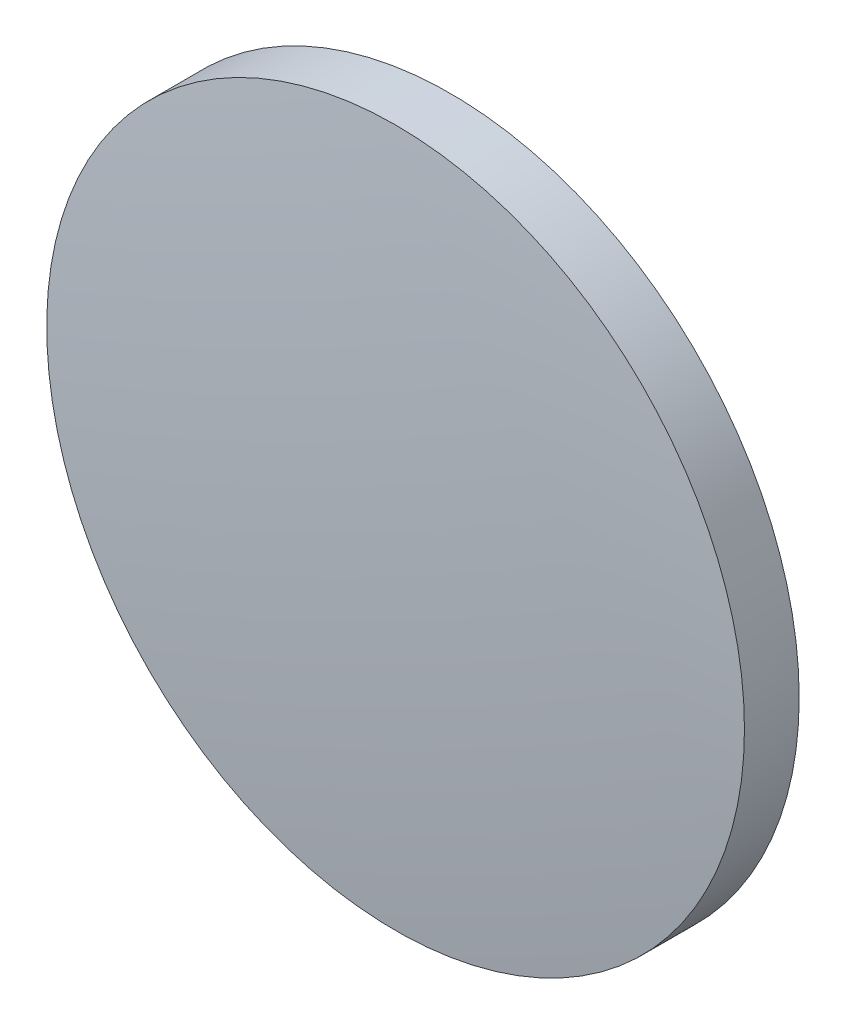
ISO-10303-21;
HEADER;
FILE_DESCRIPTION(('STEP AP214'),'2;1');
FILE_NAME('part.step','',(''),(''),'','','');
FILE_SCHEMA(('AUTOMOTIVE_DESIGN { 1 0 10303 214 1 1 1 1 }'));
ENDSEC;
DATA;
#1=APPLICATION_CONTEXT('core data for automotive mechanical design processes');
#2=APPLICATION_PROTOCOL_DEFINITION('international standard','automotive_design',2000,#1);
#3=PRODUCT_CONTEXT('',#1,'mechanical');
#4=PRODUCT('Part','Part','',(#3));
#5=PRODUCT_RELATED_PRODUCT_CATEGORY('part','',(#4));
#6=PRODUCT_DEFINITION_FORMATION('','',#4);
#7=PRODUCT_DEFINITION_CONTEXT('part definition',#1,'design');
#8=PRODUCT_DEFINITION('design','',#6,#7);
#9=PRODUCT_DEFINITION_SHAPE('','',#8);
#10=(LENGTH_UNIT() NAMED_UNIT(*) SI_UNIT(.MILLI.,.METRE.));
#11=(NAMED_UNIT(*) PLANE_ANGLE_UNIT() SI_UNIT($,.RADIAN.));
#12=(NAMED_UNIT(*) SI_UNIT($,.STERADIAN.) SOLID_ANGLE_UNIT());
#13=UNCERTAINTY_MEASURE_WITH_UNIT(LENGTH_MEASURE(1.E-05),#10,'distance_accuracy_value','');
#14=(GEOMETRIC_REPRESENTATION_CONTEXT(3) GLOBAL_UNCERTAINTY_ASSIGNED_CONTEXT((#13)) GLOBAL_UNIT_ASSIGNED_CONTEXT((#10,
#11,#12)) REPRESENTATION_CONTEXT('',''));
#15=CARTESIAN_POINT('',(0.,0.,0.));
#16=DIRECTION('',(0.,0.,1.));
#17=DIRECTION('',(1.,0.,0.));
#18=AXIS2_PLACEMENT_3D('',#15,#16,#17);
#19=CARTESIAN_POINT('',(0.,0.,-127.46));
#20=DIRECTION('',(0.,0.,1.));
#21=DIRECTION('',(0.,1.,0.));
#22=AXIS2_PLACEMENT_3D('',#19,#20,#21);
#23=SPHERICAL_SURFACE('',#22,128.77);
#24=CARTESIAN_POINT('',(0.,0.,0.682197967726477));
#25=DIRECTION('',(0.,0.,1.));
#26=DIRECTION('',(1.,0.,0.));
#27=AXIS2_PLACEMENT_3D('',#24,#25,#26);
#28=CIRCLE('',#27,12.7);
#29=CARTESIAN_POINT('',(12.7,0.,0.682197967726477));
#30=VERTEX_POINT('',#29);
#31=EDGE_CURVE('E8',#30,#30,#28,.T.);
#32=ORIENTED_EDGE('',*,*,#31,.T.);
#33=EDGE_LOOP('',(#32));
#34=FACE_BOUND('',#33,.T.);
#35=ADVANCED_FACE('F12',(#34),#23,.T.);
#36=CARTESIAN_POINT('',(0.,0.,4.30813204540037));
#37=DIRECTION('',(0.,0.,1.));
#38=DIRECTION('',(1.,0.,0.));
#39=AXIS2_PLACEMENT_3D('',#36,#37,#38);
#40=CYLINDRICAL_SURFACE('',#39,12.7);
#41=ORIENTED_EDGE('',*,*,#31,.F.);
#42=EDGE_LOOP('',(#41));
#43=FACE_BOUND('',#42,.T.);
#44=CARTESIAN_POINT('',(0.,0.,-1.31));
#45=DIRECTION('',(0.,0.,1.));
#46=DIRECTION('',(1.,0.,0.));
#47=AXIS2_PLACEMENT_3D('',#44,#45,#46);
#48=CIRCLE('',#47,12.7);
#49=CARTESIAN_POINT('',(12.7,0.,-1.31));
#50=VERTEX_POINT('',#49);
#51=EDGE_CURVE('E18',#50,#50,#48,.T.);
#52=ORIENTED_EDGE('',*,*,#51,.T.);
#53=EDGE_LOOP('',(#52));
#54=FACE_BOUND('',#53,.T.);
#55=ADVANCED_FACE('F24',(#43,#54),#40,.T.);
#56=CARTESIAN_POINT('',(0.,0.,-1.31));
#57=DIRECTION('',(0.,0.,1.));
#58=DIRECTION('',(1.,0.,0.));
#59=AXIS2_PLACEMENT_3D('',#56,#57,#58);
#60=PLANE('',#59);
#61=ORIENTED_EDGE('',*,*,#51,.F.);
#62=EDGE_LOOP('',(#61));
#63=FACE_BOUND('',#62,.T.);
#64=ADVANCED_FACE('F26',(#63),#60,.F.);
#65=CLOSED_SHELL('',(#35,#55,#64));
#66=MANIFOLD_SOLID_BREP('B1',#65);
#67=ADVANCED_BREP_SHAPE_REPRESENTATION('',(#18,#66),#14);
#68=SHAPE_DEFINITION_REPRESENTATION(#9,#67);
ENDSEC;
END-ISO-10303-21;
